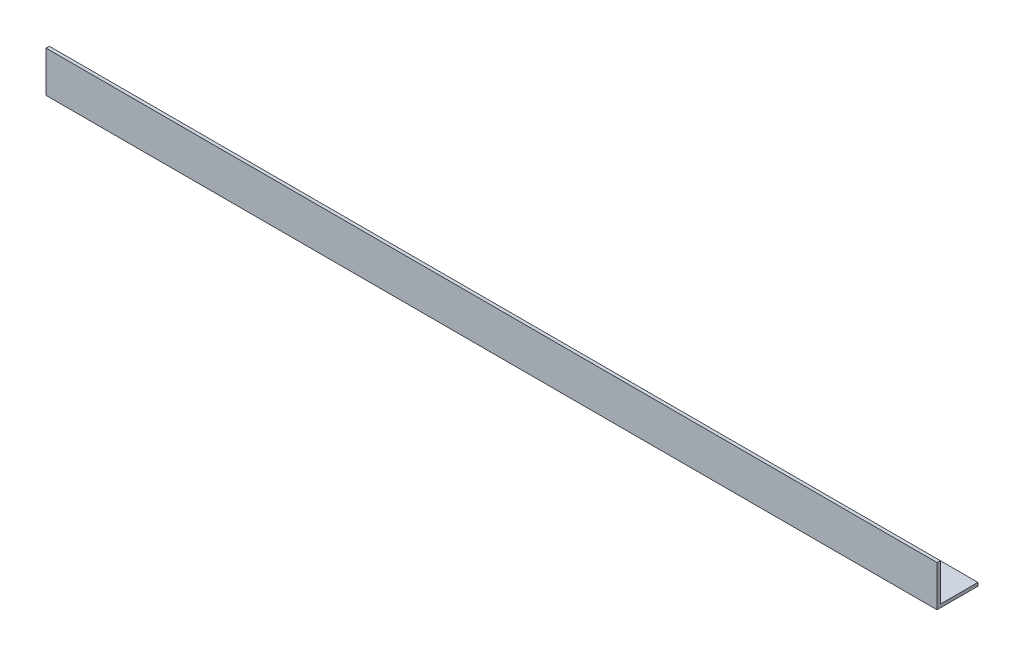
ISO-10303-21;
HEADER;
FILE_DESCRIPTION(('STEP AP214'),'2;1');
FILE_NAME('part.step','',(''),(''),'','','');
FILE_SCHEMA(('AUTOMOTIVE_DESIGN { 1 0 10303 214 1 1 1 1 }'));
ENDSEC;
DATA;
#1=APPLICATION_CONTEXT('core data for automotive mechanical design processes');
#2=APPLICATION_PROTOCOL_DEFINITION('international standard','automotive_design',2000,#1);
#3=PRODUCT_CONTEXT('',#1,'mechanical');
#4=PRODUCT('Part','Part','',(#3));
#5=PRODUCT_RELATED_PRODUCT_CATEGORY('part','',(#4));
#6=PRODUCT_DEFINITION_FORMATION('','',#4);
#7=PRODUCT_DEFINITION_CONTEXT('part definition',#1,'design');
#8=PRODUCT_DEFINITION('design','',#6,#7);
#9=PRODUCT_DEFINITION_SHAPE('','',#8);
#10=(LENGTH_UNIT() NAMED_UNIT(*) SI_UNIT(.MILLI.,.METRE.));
#11=(NAMED_UNIT(*) PLANE_ANGLE_UNIT() SI_UNIT($,.RADIAN.));
#12=(NAMED_UNIT(*) SI_UNIT($,.STERADIAN.) SOLID_ANGLE_UNIT());
#13=UNCERTAINTY_MEASURE_WITH_UNIT(LENGTH_MEASURE(1.E-05),#10,'distance_accuracy_value','');
#14=(GEOMETRIC_REPRESENTATION_CONTEXT(3) GLOBAL_UNCERTAINTY_ASSIGNED_CONTEXT((#13)) GLOBAL_UNIT_ASSIGNED_CONTEXT((#10,
#11,#12)) REPRESENTATION_CONTEXT('',''));
#15=CARTESIAN_POINT('',(0.,0.,0.));
#16=DIRECTION('',(0.,0.,1.));
#17=DIRECTION('',(1.,0.,0.));
#18=AXIS2_PLACEMENT_3D('',#15,#16,#17);
#19=CARTESIAN_POINT('',(820.,0.,0.));
#20=DIRECTION('',(0.,1.,0.));
#21=DIRECTION('',(0.,0.,1.));
#22=AXIS2_PLACEMENT_3D('',#19,#20,#21);
#23=PLANE('',#22);
#24=DIRECTION('',(0.,0.,-1.));
#25=VECTOR('',#24,1.);
#26=CARTESIAN_POINT('',(0.,0.,0.));
#27=LINE('',#26,#25);
#28=CARTESIAN_POINT('',(0.,0.,0.));
#29=VERTEX_POINT('',#28);
#30=CARTESIAN_POINT('',(0.,0.,-37.7));
#31=VERTEX_POINT('',#30);
#32=EDGE_CURVE('E115',#29,#31,#27,.T.);
#33=ORIENTED_EDGE('',*,*,#32,.T.);
#34=DIRECTION('',(-1.,0.,0.));
#35=VECTOR('',#34,1.);
#36=CARTESIAN_POINT('',(820.,0.,-37.7));
#37=LINE('',#36,#35);
#38=CARTESIAN_POINT('',(820.,0.,-37.7));
#39=VERTEX_POINT('',#38);
#40=EDGE_CURVE('E11',#39,#31,#37,.T.);
#41=ORIENTED_EDGE('',*,*,#40,.F.);
#42=DIRECTION('',(0.,0.,-1.));
#43=VECTOR('',#42,1.);
#44=CARTESIAN_POINT('',(820.,0.,0.));
#45=LINE('',#44,#43);
#46=CARTESIAN_POINT('',(820.,0.,0.));
#47=VERTEX_POINT('',#46);
#48=EDGE_CURVE('E80',#47,#39,#45,.T.);
#49=ORIENTED_EDGE('',*,*,#48,.F.);
#50=DIRECTION('',(-1.,0.,0.));
#51=VECTOR('',#50,1.);
#52=CARTESIAN_POINT('',(820.,0.,0.));
#53=LINE('',#52,#51);
#54=EDGE_CURVE('E111',#47,#29,#53,.T.);
#55=ORIENTED_EDGE('',*,*,#54,.T.);
#56=EDGE_LOOP('',(#33,#41,#49,#55));
#57=FACE_BOUND('',#56,.T.);
#58=ADVANCED_FACE('F34',(#57),#23,.F.);
#59=CARTESIAN_POINT('',(820.,3.,-37.7));
#60=DIRECTION('',(0.,0.,-1.));
#61=DIRECTION('',(-1.,0.,0.));
#62=AXIS2_PLACEMENT_3D('',#59,#60,#61);
#63=PLANE('',#62);
#64=DIRECTION('',(0.,-1.,0.));
#65=VECTOR('',#64,1.);
#66=CARTESIAN_POINT('',(0.,3.,-37.7));
#67=LINE('',#66,#65);
#68=CARTESIAN_POINT('',(0.,3.,-37.7));
#69=VERTEX_POINT('',#68);
#70=EDGE_CURVE('E118',#69,#31,#67,.T.);
#71=ORIENTED_EDGE('',*,*,#70,.F.);
#72=DIRECTION('',(-1.,0.,0.));
#73=VECTOR('',#72,1.);
#74=CARTESIAN_POINT('',(820.,3.,-37.7));
#75=LINE('',#74,#73);
#76=CARTESIAN_POINT('',(820.,3.,-37.7));
#77=VERTEX_POINT('',#76);
#78=EDGE_CURVE('E42',#77,#69,#75,.T.);
#79=ORIENTED_EDGE('',*,*,#78,.F.);
#80=DIRECTION('',(0.,-1.,0.));
#81=VECTOR('',#80,1.);
#82=CARTESIAN_POINT('',(820.,3.,-37.7));
#83=LINE('',#82,#81);
#84=EDGE_CURVE('E204',#77,#39,#83,.T.);
#85=ORIENTED_EDGE('',*,*,#84,.T.);
#86=ORIENTED_EDGE('',*,*,#40,.T.);
#87=EDGE_LOOP('',(#71,#79,#85,#86));
#88=FACE_BOUND('',#87,.T.);
#89=ADVANCED_FACE('F136',(#88),#63,.T.);
#90=CARTESIAN_POINT('',(820.,3.,0.));
#91=DIRECTION('',(0.,1.,0.));
#92=DIRECTION('',(0.,0.,1.));
#93=AXIS2_PLACEMENT_3D('',#90,#91,#92);
#94=PLANE('',#93);
#95=DIRECTION('',(0.,0.,-1.));
#96=VECTOR('',#95,1.);
#97=CARTESIAN_POINT('',(0.,3.,0.));
#98=LINE('',#97,#96);
#99=CARTESIAN_POINT('',(0.,3.,-3.));
#100=VERTEX_POINT('',#99);
#101=EDGE_CURVE('E121',#100,#69,#98,.T.);
#102=ORIENTED_EDGE('',*,*,#101,.F.);
#103=DIRECTION('',(-1.,0.,0.));
#104=VECTOR('',#103,1.);
#105=CARTESIAN_POINT('',(820.,3.,-3.));
#106=LINE('',#105,#104);
#107=CARTESIAN_POINT('',(820.,3.,-3.));
#108=VERTEX_POINT('',#107);
#109=EDGE_CURVE('E101',#108,#100,#106,.T.);
#110=ORIENTED_EDGE('',*,*,#109,.F.);
#111=DIRECTION('',(0.,0.,-1.));
#112=VECTOR('',#111,1.);
#113=CARTESIAN_POINT('',(820.,3.,0.));
#114=LINE('',#113,#112);
#115=EDGE_CURVE('E107',#108,#77,#114,.T.);
#116=ORIENTED_EDGE('',*,*,#115,.T.);
#117=ORIENTED_EDGE('',*,*,#78,.T.);
#118=EDGE_LOOP('',(#102,#110,#116,#117));
#119=FACE_BOUND('',#118,.T.);
#120=ADVANCED_FACE('F133',(#119),#94,.T.);
#121=CARTESIAN_POINT('',(820.,37.7,-3.));
#122=DIRECTION('',(0.,0.,-1.));
#123=DIRECTION('',(0.,1.,0.));
#124=AXIS2_PLACEMENT_3D('',#121,#122,#123);
#125=PLANE('',#124);
#126=DIRECTION('',(0.,-1.,0.));
#127=VECTOR('',#126,1.);
#128=CARTESIAN_POINT('',(0.,37.7,-3.));
#129=LINE('',#128,#127);
#130=CARTESIAN_POINT('',(0.,37.7,-3.));
#131=VERTEX_POINT('',#130);
#132=EDGE_CURVE('E96',#131,#100,#129,.T.);
#133=ORIENTED_EDGE('',*,*,#132,.F.);
#134=DIRECTION('',(-1.,0.,0.));
#135=VECTOR('',#134,1.);
#136=CARTESIAN_POINT('',(820.,37.7,-3.));
#137=LINE('',#136,#135);
#138=CARTESIAN_POINT('',(820.,37.7,-3.));
#139=VERTEX_POINT('',#138);
#140=EDGE_CURVE('E91',#139,#131,#137,.T.);
#141=ORIENTED_EDGE('',*,*,#140,.F.);
#142=DIRECTION('',(0.,-1.,0.));
#143=VECTOR('',#142,1.);
#144=CARTESIAN_POINT('',(820.,37.7,-3.));
#145=LINE('',#144,#143);
#146=EDGE_CURVE('E94',#139,#108,#145,.T.);
#147=ORIENTED_EDGE('',*,*,#146,.T.);
#148=ORIENTED_EDGE('',*,*,#109,.T.);
#149=EDGE_LOOP('',(#133,#141,#147,#148));
#150=FACE_BOUND('',#149,.T.);
#151=ADVANCED_FACE('F93',(#150),#125,.T.);
#152=CARTESIAN_POINT('',(820.,37.7,0.));
#153=DIRECTION('',(0.,1.,0.));
#154=DIRECTION('',(0.,0.,1.));
#155=AXIS2_PLACEMENT_3D('',#152,#153,#154);
#156=PLANE('',#155);
#157=DIRECTION('',(0.,0.,-1.));
#158=VECTOR('',#157,1.);
#159=CARTESIAN_POINT('',(0.,37.7,0.));
#160=LINE('',#159,#158);
#161=CARTESIAN_POINT('',(0.,37.7,0.));
#162=VERTEX_POINT('',#161);
#163=EDGE_CURVE('E125',#162,#131,#160,.T.);
#164=ORIENTED_EDGE('',*,*,#163,.F.);
#165=DIRECTION('',(-1.,0.,0.));
#166=VECTOR('',#165,1.);
#167=CARTESIAN_POINT('',(820.,37.7,0.));
#168=LINE('',#167,#166);
#169=CARTESIAN_POINT('',(820.,37.7,0.));
#170=VERTEX_POINT('',#169);
#171=EDGE_CURVE('E71',#170,#162,#168,.T.);
#172=ORIENTED_EDGE('',*,*,#171,.F.);
#173=DIRECTION('',(0.,0.,-1.));
#174=VECTOR('',#173,1.);
#175=CARTESIAN_POINT('',(820.,37.7,0.));
#176=LINE('',#175,#174);
#177=EDGE_CURVE('E105',#170,#139,#176,.T.);
#178=ORIENTED_EDGE('',*,*,#177,.T.);
#179=ORIENTED_EDGE('',*,*,#140,.T.);
#180=EDGE_LOOP('',(#164,#172,#178,#179));
#181=FACE_BOUND('',#180,.T.);
#182=ADVANCED_FACE('F109',(#181),#156,.T.);
#183=CARTESIAN_POINT('',(820.,37.7,0.));
#184=DIRECTION('',(0.,0.,-1.));
#185=DIRECTION('',(0.,1.,0.));
#186=AXIS2_PLACEMENT_3D('',#183,#184,#185);
#187=PLANE('',#186);
#188=DIRECTION('',(0.,-1.,0.));
#189=VECTOR('',#188,1.);
#190=CARTESIAN_POINT('',(0.,37.7,0.));
#191=LINE('',#190,#189);
#192=EDGE_CURVE('E74',#162,#29,#191,.T.);
#193=ORIENTED_EDGE('',*,*,#192,.T.);
#194=ORIENTED_EDGE('',*,*,#54,.F.);
#195=DIRECTION('',(0.,-1.,0.));
#196=VECTOR('',#195,1.);
#197=CARTESIAN_POINT('',(820.,37.7,0.));
#198=LINE('',#197,#196);
#199=EDGE_CURVE('E50',#170,#47,#198,.T.);
#200=ORIENTED_EDGE('',*,*,#199,.F.);
#201=ORIENTED_EDGE('',*,*,#171,.T.);
#202=EDGE_LOOP('',(#193,#194,#200,#201));
#203=FACE_BOUND('',#202,.T.);
#204=ADVANCED_FACE('F141',(#203),#187,.F.);
#205=CARTESIAN_POINT('',(820.,0.,0.));
#206=DIRECTION('',(-1.,0.,0.));
#207=DIRECTION('',(0.,0.,1.));
#208=AXIS2_PLACEMENT_3D('',#205,#206,#207);
#209=PLANE('',#208);
#210=ORIENTED_EDGE('',*,*,#48,.T.);
#211=ORIENTED_EDGE('',*,*,#84,.F.);
#212=ORIENTED_EDGE('',*,*,#115,.F.);
#213=ORIENTED_EDGE('',*,*,#146,.F.);
#214=ORIENTED_EDGE('',*,*,#177,.F.);
#215=ORIENTED_EDGE('',*,*,#199,.T.);
#216=EDGE_LOOP('',(#210,#211,#212,#213,#214,#215));
#217=FACE_BOUND('',#216,.T.);
#218=ADVANCED_FACE('F104',(#217),#209,.F.);
#219=CARTESIAN_POINT('',(0.,0.,0.));
#220=DIRECTION('',(-1.,0.,0.));
#221=DIRECTION('',(0.,0.,1.));
#222=AXIS2_PLACEMENT_3D('',#219,#220,#221);
#223=PLANE('',#222);
#224=ORIENTED_EDGE('',*,*,#32,.F.);
#225=ORIENTED_EDGE('',*,*,#192,.F.);
#226=ORIENTED_EDGE('',*,*,#163,.T.);
#227=ORIENTED_EDGE('',*,*,#132,.T.);
#228=ORIENTED_EDGE('',*,*,#101,.T.);
#229=ORIENTED_EDGE('',*,*,#70,.T.);
#230=EDGE_LOOP('',(#224,#225,#226,#227,#228,#229));
#231=FACE_BOUND('',#230,.T.);
#232=ADVANCED_FACE('F139',(#231),#223,.T.);
#233=CLOSED_SHELL('',(#58,#89,#120,#151,#182,#204,#218,#232));
#234=MANIFOLD_SOLID_BREP('B2',#233);
#235=ADVANCED_BREP_SHAPE_REPRESENTATION('',(#18,#234),#14);
#236=SHAPE_DEFINITION_REPRESENTATION(#9,#235);
ENDSEC;
END-ISO-10303-21;
